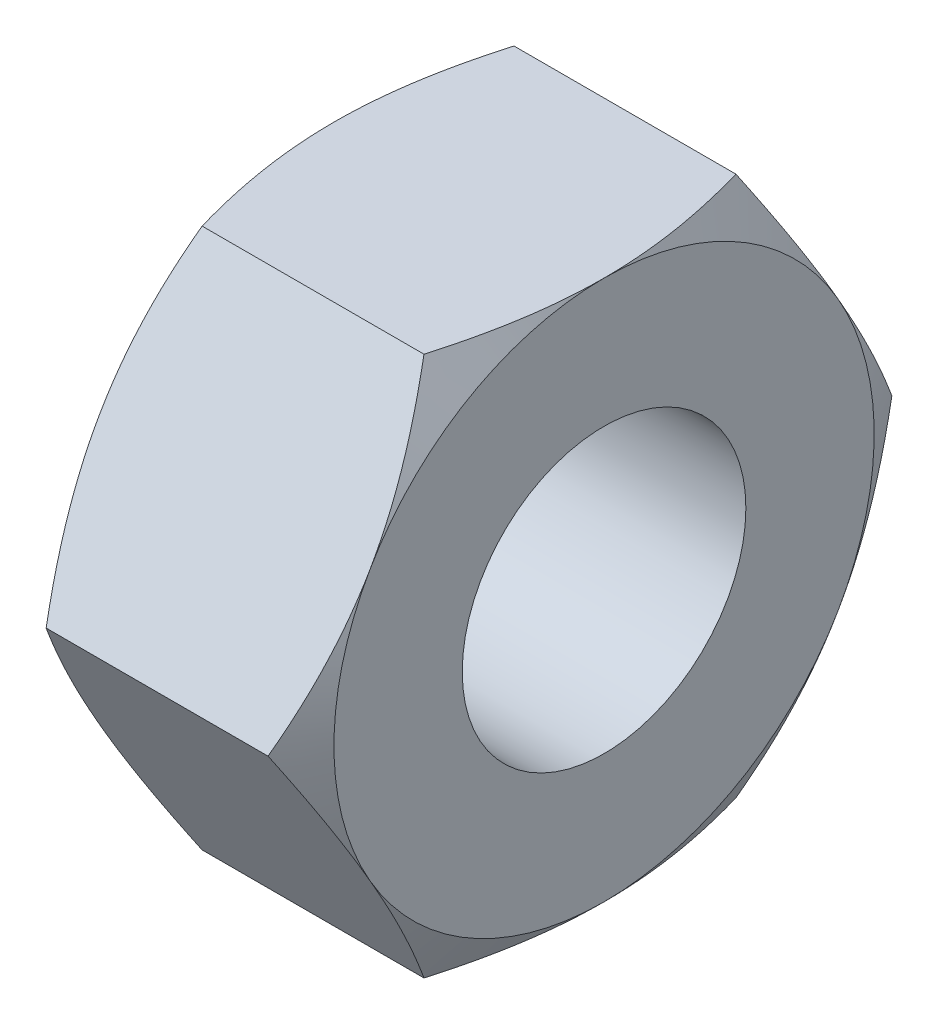
ISO-10303-21;
HEADER;
FILE_DESCRIPTION(('STEP AP214'),'2;1');
FILE_NAME('part.step','',(''),(''),'','','');
FILE_SCHEMA(('AUTOMOTIVE_DESIGN { 1 0 10303 214 1 1 1 1 }'));
ENDSEC;
DATA;
#1=APPLICATION_CONTEXT('core data for automotive mechanical design processes');
#2=APPLICATION_PROTOCOL_DEFINITION('international standard','automotive_design',2000,#1);
#3=PRODUCT_CONTEXT('',#1,'mechanical');
#4=PRODUCT('Part','Part','',(#3));
#5=PRODUCT_RELATED_PRODUCT_CATEGORY('part','',(#4));
#6=PRODUCT_DEFINITION_FORMATION('','',#4);
#7=PRODUCT_DEFINITION_CONTEXT('part definition',#1,'design');
#8=PRODUCT_DEFINITION('design','',#6,#7);
#9=PRODUCT_DEFINITION_SHAPE('','',#8);
#10=(LENGTH_UNIT() NAMED_UNIT(*) SI_UNIT(.MILLI.,.METRE.));
#11=(NAMED_UNIT(*) PLANE_ANGLE_UNIT() SI_UNIT($,.RADIAN.));
#12=(NAMED_UNIT(*) SI_UNIT($,.STERADIAN.) SOLID_ANGLE_UNIT());
#13=UNCERTAINTY_MEASURE_WITH_UNIT(LENGTH_MEASURE(1.E-05),#10,'distance_accuracy_value','');
#14=(GEOMETRIC_REPRESENTATION_CONTEXT(3) GLOBAL_UNCERTAINTY_ASSIGNED_CONTEXT((#13)) GLOBAL_UNIT_ASSIGNED_CONTEXT((#10,
#11,#12)) REPRESENTATION_CONTEXT('',''));
#15=CARTESIAN_POINT('',(0.,0.,0.));
#16=DIRECTION('',(0.,0.,1.));
#17=DIRECTION('',(1.,0.,0.));
#18=AXIS2_PLACEMENT_3D('',#15,#16,#17);
#19=CARTESIAN_POINT('',(-2.,-4.,-2.30940107675851));
#20=DIRECTION('',(-1.,0.,0.));
#21=DIRECTION('',(0.,0.,1.));
#22=AXIS2_PLACEMENT_3D('',#19,#20,#21);
#23=PLANE('',#22);
#24=CARTESIAN_POINT('',(-2.,0.,0.));
#25=DIRECTION('',(1.,0.,0.));
#26=DIRECTION('',(0.,0.,-1.));
#27=AXIS2_PLACEMENT_3D('',#24,#25,#26);
#28=CIRCLE('',#27,2.1);
#29=CARTESIAN_POINT('',(-2.,0.,-2.1));
#30=VERTEX_POINT('',#29);
#31=EDGE_CURVE('E133',#30,#30,#28,.T.);
#32=ORIENTED_EDGE('',*,*,#31,.T.);
#33=EDGE_LOOP('',(#32));
#34=FACE_BOUND('',#33,.T.);
#35=CARTESIAN_POINT('',(-2.,0.,0.));
#36=DIRECTION('',(1.,0.,0.));
#37=DIRECTION('',(0.,0.,-1.));
#38=AXIS2_PLACEMENT_3D('',#35,#36,#37);
#39=CIRCLE('',#38,4.);
#40=CARTESIAN_POINT('',(-2.,4.,0.));
#41=VERTEX_POINT('',#40);
#42=CARTESIAN_POINT('',(-2.,2.,3.46410161513775));
#43=VERTEX_POINT('',#42);
#44=EDGE_CURVE('E480',#41,#43,#39,.T.);
#45=ORIENTED_EDGE('',*,*,#44,.F.);
#46=CARTESIAN_POINT('',(-2.,2.,-3.46410161513775));
#47=VERTEX_POINT('',#46);
#48=EDGE_CURVE('E220',#47,#41,#39,.T.);
#49=ORIENTED_EDGE('',*,*,#48,.F.);
#50=CARTESIAN_POINT('',(-2.,-2.,-3.46410161513775));
#51=VERTEX_POINT('',#50);
#52=EDGE_CURVE('E31',#51,#47,#39,.T.);
#53=ORIENTED_EDGE('',*,*,#52,.F.);
#54=CARTESIAN_POINT('',(-2.,-4.,0.));
#55=VERTEX_POINT('',#54);
#56=EDGE_CURVE('E35',#55,#51,#39,.T.);
#57=ORIENTED_EDGE('',*,*,#56,.F.);
#58=CARTESIAN_POINT('',(-2.,-2.,3.46410161513775));
#59=VERTEX_POINT('',#58);
#60=EDGE_CURVE('E481',#59,#55,#39,.T.);
#61=ORIENTED_EDGE('',*,*,#60,.F.);
#62=EDGE_CURVE('E294',#43,#59,#39,.T.);
#63=ORIENTED_EDGE('',*,*,#62,.F.);
#64=EDGE_LOOP('',(#45,#49,#53,#57,#61,#63));
#65=FACE_BOUND('',#64,.T.);
#66=ADVANCED_FACE('F16',(#34,#65),#23,.T.);
#67=CARTESIAN_POINT('',(2.,-4.,-2.30940107675851));
#68=DIRECTION('',(0.,0.5,0.866025403784439));
#69=DIRECTION('',(0.,-0.866025403784439,0.5));
#70=AXIS2_PLACEMENT_3D('',#67,#68,#69);
#71=PLANE('',#70);
#72=CARTESIAN_POINT('',(-1.64266774092524,0.000199999999998344,-4.61891762357084));
#73=CARTESIAN_POINT('',(-1.70128212635172,-0.175579150323231,-4.5174314838138));
#74=CARTESIAN_POINT('',(-1.75458967853774,-0.352875616326384,-4.41506932144051));
#75=CARTESIAN_POINT('',(-1.8476383292536,-0.71053859317571,-4.20857250547739));
#76=CARTESIAN_POINT('',(-1.8873465109703,-0.890911458970154,-4.10443418285647));
#77=CARTESIAN_POINT('',(-1.94915778471972,-1.24942181870279,-3.89744813015756));
#78=CARTESIAN_POINT('',(-1.97167226847711,-1.42750415293514,-3.79463224655059));
#79=CARTESIAN_POINT('',(-1.99854937685342,-1.78450671716651,-3.58851671999023));
#80=CARTESIAN_POINT('',(-2.00293425857306,-1.9634256496441,-3.48521782616117));
#81=CARTESIAN_POINT('',(-1.99380992706003,-2.29774284219674,-3.29219970504619));
#82=CARTESIAN_POINT('',(-1.982541046012,-2.45319115998707,-3.20245157692486));
#83=CARTESIAN_POINT('',(-1.94682600920181,-2.76307505563506,-3.02354002635497));
#84=CARTESIAN_POINT('',(-1.92236765428847,-2.91750956174413,-2.93437722268073));
#85=CARTESIAN_POINT('',(-1.86122393508071,-3.22803232777458,-2.75509682012354));
#86=CARTESIAN_POINT('',(-1.82427939634514,-3.3840812880631,-2.6650019108942));
#87=CARTESIAN_POINT('',(-1.74042992745197,-3.69385183540384,-2.48615580200001));
#88=CARTESIAN_POINT('',(-1.69354469778726,-3.84757739077378,-2.39740231122585));
#89=CARTESIAN_POINT('',(-1.64266774092524,-4.0002,-2.30928560670467));
#90=B_SPLINE_CURVE_WITH_KNOTS('',3,(#72,#73,#74,#75,#76,#77,#78,#79,#80,#81,#82,#83,#84,#85,#86,
#87,#88,#89),.UNSPECIFIED.,.F.,.F.,(4,2,2,2,2,2,2,2,4),(0.,0.634047835695965,1.26961969224543,
1.88946157213122,2.50854226669297,3.04757825393385,3.58711366126903,4.13861653143763,
4.68903648037742),.UNSPECIFIED.);
#91=CARTESIAN_POINT('',(-1.64273441009184,-4.,-2.30940107675851));
#92=VERTEX_POINT('',#91);
#93=EDGE_CURVE('E102',#51,#92,#90,.T.);
#94=ORIENTED_EDGE('',*,*,#93,.F.);
#95=CARTESIAN_POINT('',(-1.64273441009184,0.,-4.61880215351701));
#96=VERTEX_POINT('',#95);
#97=EDGE_CURVE('E111',#96,#51,#90,.T.);
#98=ORIENTED_EDGE('',*,*,#97,.F.);
#99=DIRECTION('',(-1.,0.,0.));
#100=VECTOR('',#99,1.);
#101=CARTESIAN_POINT('',(2.,0.,-4.61880215351701));
#102=LINE('',#101,#100);
#103=CARTESIAN_POINT('',(1.64273441009184,0.,-4.61880215351701));
#104=VERTEX_POINT('',#103);
#105=EDGE_CURVE('E11',#104,#96,#102,.T.);
#106=ORIENTED_EDGE('',*,*,#105,.F.);
#107=CARTESIAN_POINT('',(1.64266774092524,0.000199999999998344,-4.61891762357084));
#108=CARTESIAN_POINT('',(1.70128212635172,-0.175579150323231,-4.5174314838138));
#109=CARTESIAN_POINT('',(1.75458967853774,-0.352875616326384,-4.41506932144051));
#110=CARTESIAN_POINT('',(1.8476383292536,-0.71053859317571,-4.20857250547739));
#111=CARTESIAN_POINT('',(1.8873465109703,-0.890911458970154,-4.10443418285647));
#112=CARTESIAN_POINT('',(1.94915778471972,-1.24942181870279,-3.89744813015756));
#113=CARTESIAN_POINT('',(1.97167226847711,-1.42750415293514,-3.79463224655059));
#114=CARTESIAN_POINT('',(1.99854937685342,-1.78450671716651,-3.58851671999023));
#115=CARTESIAN_POINT('',(2.00293425857306,-1.9634256496441,-3.48521782616117));
#116=CARTESIAN_POINT('',(1.99380992706003,-2.29774284219674,-3.29219970504619));
#117=CARTESIAN_POINT('',(1.982541046012,-2.45319115998707,-3.20245157692486));
#118=CARTESIAN_POINT('',(1.94682600920181,-2.76307505563506,-3.02354002635497));
#119=CARTESIAN_POINT('',(1.92236765428847,-2.91750956174413,-2.93437722268073));
#120=CARTESIAN_POINT('',(1.86122393508071,-3.22803232777458,-2.75509682012354));
#121=CARTESIAN_POINT('',(1.82427939634514,-3.3840812880631,-2.6650019108942));
#122=CARTESIAN_POINT('',(1.74042992745197,-3.69385183540384,-2.48615580200001));
#123=CARTESIAN_POINT('',(1.69354469778726,-3.84757739077378,-2.39740231122585));
#124=CARTESIAN_POINT('',(1.64266774092524,-4.0002,-2.30928560670467));
#125=B_SPLINE_CURVE_WITH_KNOTS('',3,(#107,#108,#109,#110,#111,#112,#113,#114,#115,#116,#117,
#118,#119,#120,#121,#122,#123,#124),.UNSPECIFIED.,.F.,.F.,(4,2,2,2,2,2,2,2,4),(0.,
0.634047835695965,1.26961969224543,1.88946157213122,2.50854226669297,3.04757825393385,
3.58711366126903,4.13861653143763,4.68903648037742),.UNSPECIFIED.);
#126=CARTESIAN_POINT('',(2.,-2.,-3.46410161513775));
#127=VERTEX_POINT('',#126);
#128=EDGE_CURVE('E166',#104,#127,#125,.T.);
#129=ORIENTED_EDGE('',*,*,#128,.T.);
#130=CARTESIAN_POINT('',(1.6427344100922,-4.,-2.30940107675906));
#131=VERTEX_POINT('',#130);
#132=EDGE_CURVE('E125',#127,#131,#125,.T.);
#133=ORIENTED_EDGE('',*,*,#132,.T.);
#134=DIRECTION('',(-1.,0.,0.));
#135=VECTOR('',#134,1.);
#136=CARTESIAN_POINT('',(2.,-4.,-2.30940107675851));
#137=LINE('',#136,#135);
#138=EDGE_CURVE('E118',#131,#92,#137,.T.);
#139=ORIENTED_EDGE('',*,*,#138,.T.);
#140=EDGE_LOOP('',(#94,#98,#106,#129,#133,#139));
#141=FACE_BOUND('',#140,.T.);
#142=ADVANCED_FACE('F18',(#141),#71,.F.);
#143=CARTESIAN_POINT('',(2.,0.,-4.61880215351701));
#144=DIRECTION('',(0.,-0.5,0.866025403784439));
#145=DIRECTION('',(0.,-0.866025403784439,-0.5));
#146=AXIS2_PLACEMENT_3D('',#143,#144,#145);
#147=PLANE('',#146);
#148=CARTESIAN_POINT('',(-1.64266774092524,4.0002,-2.30928560670467));
#149=CARTESIAN_POINT('',(-1.70128212635172,3.82442084967677,-2.41077174646171));
#150=CARTESIAN_POINT('',(-1.75458967853774,3.64712438367362,-2.513133908835));
#151=CARTESIAN_POINT('',(-1.8476383292536,3.2894614068243,-2.71963072479812));
#152=CARTESIAN_POINT('',(-1.88734651097029,3.10908854102985,-2.82376904741904));
#153=CARTESIAN_POINT('',(-1.94915778471972,2.75057818129721,-3.03075510011795));
#154=CARTESIAN_POINT('',(-1.97167226847711,2.57249584706486,-3.13357098372492));
#155=CARTESIAN_POINT('',(-1.99854937685342,2.21549328283349,-3.33968651028528));
#156=CARTESIAN_POINT('',(-2.00293425857306,2.0365743503559,-3.44298540411434));
#157=CARTESIAN_POINT('',(-1.99380992706003,1.70225715780327,-3.63600352522932));
#158=CARTESIAN_POINT('',(-1.982541046012,1.54680884001294,-3.72575165335065));
#159=CARTESIAN_POINT('',(-1.94682600920181,1.23692494436495,-3.90466320392055));
#160=CARTESIAN_POINT('',(-1.92236765428847,1.08249043825587,-3.99382600759479));
#161=CARTESIAN_POINT('',(-1.86122393508071,0.771967672225423,-4.17310641015197));
#162=CARTESIAN_POINT('',(-1.82427939634514,0.615918711936899,-4.26320131938131));
#163=CARTESIAN_POINT('',(-1.74042992745197,0.306148164596162,-4.4420474282755));
#164=CARTESIAN_POINT('',(-1.69354469778726,0.152422609226222,-4.53080091904966));
#165=CARTESIAN_POINT('',(-1.64266774092524,-0.000200000000001705,-4.61891762357084));
#166=B_SPLINE_CURVE_WITH_KNOTS('',3,(#148,#149,#150,#151,#152,#153,#154,#155,#156,#157,#158,
#159,#160,#161,#162,#163,#164,#165),.UNSPECIFIED.,.F.,.F.,(4,2,2,2,2,2,2,2,4),(0.,
0.634047835695965,1.26961969224543,1.88946157213122,2.50854226669297,3.04757825393386,
3.58711366126903,4.13861653143764,4.68903648037743),.UNSPECIFIED.);
#167=EDGE_CURVE('E263',#47,#96,#166,.T.);
#168=ORIENTED_EDGE('',*,*,#167,.F.);
#169=CARTESIAN_POINT('',(-1.64273441009184,4.,-2.30940107675851));
#170=VERTEX_POINT('',#169);
#171=EDGE_CURVE('E112',#170,#47,#166,.T.);
#172=ORIENTED_EDGE('',*,*,#171,.F.);
#173=DIRECTION('',(-1.,0.,0.));
#174=VECTOR('',#173,1.);
#175=CARTESIAN_POINT('',(2.,4.,-2.30940107675851));
#176=LINE('',#175,#174);
#177=CARTESIAN_POINT('',(1.64273441009184,4.,-2.30940107675851));
#178=VERTEX_POINT('',#177);
#179=EDGE_CURVE('E24',#178,#170,#176,.T.);
#180=ORIENTED_EDGE('',*,*,#179,.F.);
#181=CARTESIAN_POINT('',(1.64266774092524,4.0002,-2.30928560670467));
#182=CARTESIAN_POINT('',(1.70128212635172,3.82442084967677,-2.41077174646171));
#183=CARTESIAN_POINT('',(1.75458967853774,3.64712438367362,-2.513133908835));
#184=CARTESIAN_POINT('',(1.8476383292536,3.2894614068243,-2.71963072479812));
#185=CARTESIAN_POINT('',(1.88734651097029,3.10908854102985,-2.82376904741904));
#186=CARTESIAN_POINT('',(1.94915778471972,2.75057818129721,-3.03075510011795));
#187=CARTESIAN_POINT('',(1.97167226847711,2.57249584706486,-3.13357098372492));
#188=CARTESIAN_POINT('',(1.99854937685342,2.21549328283349,-3.33968651028528));
#189=CARTESIAN_POINT('',(2.00293425857306,2.0365743503559,-3.44298540411434));
#190=CARTESIAN_POINT('',(1.99380992706003,1.70225715780327,-3.63600352522932));
#191=CARTESIAN_POINT('',(1.982541046012,1.54680884001294,-3.72575165335065));
#192=CARTESIAN_POINT('',(1.94682600920181,1.23692494436495,-3.90466320392055));
#193=CARTESIAN_POINT('',(1.92236765428847,1.08249043825587,-3.99382600759479));
#194=CARTESIAN_POINT('',(1.86122393508071,0.771967672225423,-4.17310641015197));
#195=CARTESIAN_POINT('',(1.82427939634514,0.615918711936899,-4.26320131938131));
#196=CARTESIAN_POINT('',(1.74042992745197,0.306148164596162,-4.4420474282755));
#197=CARTESIAN_POINT('',(1.69354469778726,0.152422609226222,-4.53080091904966));
#198=CARTESIAN_POINT('',(1.64266774092524,-0.000200000000001705,-4.61891762357084));
#199=B_SPLINE_CURVE_WITH_KNOTS('',3,(#181,#182,#183,#184,#185,#186,#187,#188,#189,#190,#191,
#192,#193,#194,#195,#196,#197,#198),.UNSPECIFIED.,.F.,.F.,(4,2,2,2,2,2,2,2,4),(0.,
0.634047835695965,1.26961969224543,1.88946157213122,2.50854226669297,3.04757825393386,
3.58711366126903,4.13861653143764,4.68903648037743),.UNSPECIFIED.);
#200=CARTESIAN_POINT('',(2.,2.,-3.46410161513775));
#201=VERTEX_POINT('',#200);
#202=EDGE_CURVE('E157',#178,#201,#199,.T.);
#203=ORIENTED_EDGE('',*,*,#202,.T.);
#204=EDGE_CURVE('E164',#201,#104,#199,.T.);
#205=ORIENTED_EDGE('',*,*,#204,.T.);
#206=ORIENTED_EDGE('',*,*,#105,.T.);
#207=EDGE_LOOP('',(#168,#172,#180,#203,#205,#206));
#208=FACE_BOUND('',#207,.T.);
#209=ADVANCED_FACE('F156',(#208),#147,.F.);
#210=CARTESIAN_POINT('',(2.,4.,-2.30940107675851));
#211=DIRECTION('',(0.,-1.,0.));
#212=DIRECTION('',(0.,0.,-1.));
#213=AXIS2_PLACEMENT_3D('',#210,#211,#212);
#214=PLANE('',#213);
#215=CARTESIAN_POINT('',(-0.0424878092924402,4.,-6.21447073339589));
#216=CARTESIAN_POINT('',(-0.127351613558699,4.,-6.0396183256206));
#217=CARTESIAN_POINT('',(-0.21140471296775,4.,-5.86436561404375));
#218=CARTESIAN_POINT('',(-0.377433582477088,4.,-5.5128466430601));
#219=CARTESIAN_POINT('',(-0.459409026889743,4.,-5.33658022999682));
#220=CARTESIAN_POINT('',(-0.621236406020319,4.,-4.98191870371583));
#221=CARTESIAN_POINT('',(-0.701074456545692,4.,-4.80351723345339));
#222=CARTESIAN_POINT('',(-0.857496478137951,4.,-4.44529861455654));
#223=CARTESIAN_POINT('',(-0.934080602505362,4.,-4.26548153308923));
#224=CARTESIAN_POINT('',(-1.08550256214435,4.,-3.89840789182473));
#225=CARTESIAN_POINT('',(-1.16020783030021,4.,-3.71109634781926));
#226=CARTESIAN_POINT('',(-1.30399127038016,4.,-3.33428626892711));
#227=CARTESIAN_POINT('',(-1.37306881288743,4.,-3.14478749211415));
#228=CARTESIAN_POINT('',(-1.503792383855,4.,-2.76365206062652));
#229=CARTESIAN_POINT('',(-1.56545333119033,4.,-2.57202057460323));
#230=CARTESIAN_POINT('',(-1.67937298125012,4.,-2.18600937849997));
#231=CARTESIAN_POINT('',(-1.73163463099794,4.,-1.99163055050095));
#232=CARTESIAN_POINT('',(-1.82399073804893,4.,-1.6010395958577));
#233=CARTESIAN_POINT('',(-1.86414824658267,4.,-1.40484265691068));
#234=CARTESIAN_POINT('',(-1.9300137776466,4.,-1.00999836516601));
#235=CARTESIAN_POINT('',(-1.95572328462399,4.,-0.811351266251908));
#236=CARTESIAN_POINT('',(-1.99030612537942,4.,-0.415198077025975));
#237=CARTESIAN_POINT('',(-1.99939684433401,4.,-0.217711443134732));
#238=CARTESIAN_POINT('',(-2.00054431746841,4.,0.177330995286892));
#239=CARTESIAN_POINT('',(-1.9926005017144,4.,0.374886801910515));
#240=CARTESIAN_POINT('',(-1.96525154953382,4.,0.709857582976532));
#241=CARTESIAN_POINT('',(-1.94997310943552,4.,0.847630200191343));
#242=CARTESIAN_POINT('',(-1.91207564794806,4.,1.12216892965561));
#243=CARTESIAN_POINT('',(-1.88945564443709,4.,1.25893490473615));
#244=CARTESIAN_POINT('',(-1.81177225564822,4.,1.66753166373138));
#245=CARTESIAN_POINT('',(-1.74689872591423,4.,1.93751819884844));
#246=CARTESIAN_POINT('',(-1.63433899420949,4.,2.34141488866647));
#247=CARTESIAN_POINT('',(-1.59372208224944,4.,2.47741402190499));
#248=CARTESIAN_POINT('',(-1.50826048812494,4.,2.74809025415673));
#249=CARTESIAN_POINT('',(-1.46341577333139,4.,2.88276734295789));
#250=CARTESIAN_POINT('',(-1.37021924621611,4.,3.15084486713317));
#251=CARTESIAN_POINT('',(-1.32186851821546,4.,3.28424568290032));
#252=CARTESIAN_POINT('',(-1.22222993029444,4.,3.54993863663534));
#253=CARTESIAN_POINT('',(-1.17094214171142,4.,3.6822308014415));
#254=CARTESIAN_POINT('',(-1.02563622023204,4.,4.04695465555703));
#255=CARTESIAN_POINT('',(-0.929021650558054,4.,4.27835104719763));
#256=CARTESIAN_POINT('',(-0.730187852964453,4.,4.73873215924535));
#257=CARTESIAN_POINT('',(-0.627967976954074,4.,4.96771659711595));
#258=CARTESIAN_POINT('',(-0.419297579372636,4.,5.4238424448388));
#259=CARTESIAN_POINT('',(-0.312845554621115,4.,5.6509831647138));
#260=CARTESIAN_POINT('',(-0.0967433277952712,4.,6.10374131486461));
#261=CARTESIAN_POINT('',(0.0129069717704638,4.,6.32935869844662));
#262=CARTESIAN_POINT('',(0.23485963439115,4.,6.77972688134291));
#263=CARTESIAN_POINT('',(0.347165922687314,4.,7.00447574225));
#264=CARTESIAN_POINT('',(0.573740552912192,4.,7.4529833078244));
#265=CARTESIAN_POINT('',(0.688008914774191,4.,7.67674200240322));
#266=CARTESIAN_POINT('',(1.03309071408151,4.,8.34671424696929));
#267=CARTESIAN_POINT('',(1.26623258411182,4.,8.7917278951712));
#268=CARTESIAN_POINT('',(1.7109069594873,4.,9.63103051544466));
#269=CARTESIAN_POINT('',(1.92201495669699,4.,10.0255454645977));
#270=CARTESIAN_POINT('',(2.34662194321588,4.,10.8133186136335));
#271=CARTESIAN_POINT('',(2.56012108495381,4.,11.2065767313191));
#272=CARTESIAN_POINT('',(2.9881698404675,4.,11.9908278398692));
#273=CARTESIAN_POINT('',(3.20271362390135,4.,12.3818240177721));
#274=CARTESIAN_POINT('',(3.63314694892205,4.,13.1630345650918));
#275=CARTESIAN_POINT('',(3.84903638181796,4.,13.5532489943723));
#276=CARTESIAN_POINT('',(4.06541385496577,4.,13.9431910057166));
#277=B_SPLINE_CURVE_WITH_KNOTS('',3,(#215,#216,#217,#218,#219,#220,#221,#222,#223,#224,#225,
#226,#227,#228,#229,#230,#231,#232,#233,#234,#235,#236,#237,#238,#239,#240,#241,#242,#243,#244,
#245,#246,#247,#248,#249,#250,#251,#252,#253,#254,#255,#256,#257,#258,#259,#260,#261,#262,#263,
#264,#265,#266,#267,#268,#269,#270,#271,#272,#273,#274,#275,#276),.UNSPECIFIED.,.F.,.F.,(4,2,2,
2,2,2,2,2,2,2,2,2,2,2,2,2,2,2,2,2,2,2,2,2,2,2,2,2,2,2,4),(0.,0.583082605837965,1.16625605579355,
1.75258384250784,2.3388839751674,2.94379211515442,3.54876781674333,4.15250547029922,
4.75605349877387,5.35640100034463,5.9566868084568,6.54906268949767,7.14145839029456,
7.55710878833946,7.97281481318691,8.80465598775476,9.23042410092923,9.65619550034297,
10.0818357765123,10.5074657188175,11.2596212520816,12.0118639343932,12.7643762290397,
13.5169114861643,14.2706385930645,15.0243733618376,16.5314946529553,17.8738267846276,
19.2162449788296,20.554212056764,21.8920724296771),.UNSPECIFIED.);
#278=EDGE_CURVE('E147',#41,#170,#277,.F.);
#279=ORIENTED_EDGE('',*,*,#278,.F.);
#280=CARTESIAN_POINT('',(-1.64273441009184,4.,2.30940107675851));
#281=VERTEX_POINT('',#280);
#282=EDGE_CURVE('E268',#281,#41,#277,.F.);
#283=ORIENTED_EDGE('',*,*,#282,.F.);
#284=DIRECTION('',(-1.,0.,0.));
#285=VECTOR('',#284,1.);
#286=CARTESIAN_POINT('',(2.,4.,2.30940107675851));
#287=LINE('',#286,#285);
#288=CARTESIAN_POINT('',(1.64273441009184,4.,2.30940107675851));
#289=VERTEX_POINT('',#288);
#290=EDGE_CURVE('E139',#289,#281,#287,.T.);
#291=ORIENTED_EDGE('',*,*,#290,.F.);
#292=CARTESIAN_POINT('',(0.0424878092924402,4.,-6.21447073339589));
#293=CARTESIAN_POINT('',(0.127351613558699,4.,-6.0396183256206));
#294=CARTESIAN_POINT('',(0.21140471296775,4.,-5.86436561404375));
#295=CARTESIAN_POINT('',(0.377433582477088,4.,-5.5128466430601));
#296=CARTESIAN_POINT('',(0.459409026889743,4.,-5.33658022999682));
#297=CARTESIAN_POINT('',(0.621236406020319,4.,-4.98191870371583));
#298=CARTESIAN_POINT('',(0.701074456545692,4.,-4.80351723345339));
#299=CARTESIAN_POINT('',(0.857496478137951,4.,-4.44529861455654));
#300=CARTESIAN_POINT('',(0.934080602505362,4.,-4.26548153308923));
#301=CARTESIAN_POINT('',(1.08550256214435,4.,-3.89840789182473));
#302=CARTESIAN_POINT('',(1.16020783030021,4.,-3.71109634781926));
#303=CARTESIAN_POINT('',(1.30399127038016,4.,-3.33428626892711));
#304=CARTESIAN_POINT('',(1.37306881288743,4.,-3.14478749211415));
#305=CARTESIAN_POINT('',(1.503792383855,4.,-2.76365206062652));
#306=CARTESIAN_POINT('',(1.56545333119033,4.,-2.57202057460323));
#307=CARTESIAN_POINT('',(1.67937298125012,4.,-2.18600937849997));
#308=CARTESIAN_POINT('',(1.73163463099794,4.,-1.99163055050095));
#309=CARTESIAN_POINT('',(1.82399073804893,4.,-1.6010395958577));
#310=CARTESIAN_POINT('',(1.86414824658267,4.,-1.40484265691068));
#311=CARTESIAN_POINT('',(1.9300137776466,4.,-1.00999836516601));
#312=CARTESIAN_POINT('',(1.95572328462399,4.,-0.811351266251908));
#313=CARTESIAN_POINT('',(1.99030612537942,4.,-0.415198077025975));
#314=CARTESIAN_POINT('',(1.99939684433401,4.,-0.217711443134732));
#315=CARTESIAN_POINT('',(2.00054431746841,4.,0.177330995286892));
#316=CARTESIAN_POINT('',(1.9926005017144,4.,0.374886801910515));
#317=CARTESIAN_POINT('',(1.96525154953382,4.,0.709857582976532));
#318=CARTESIAN_POINT('',(1.94997310943552,4.,0.847630200191343));
#319=CARTESIAN_POINT('',(1.91207564794806,4.,1.12216892965561));
#320=CARTESIAN_POINT('',(1.88945564443709,4.,1.25893490473615));
#321=CARTESIAN_POINT('',(1.81177225564822,4.,1.66753166373138));
#322=CARTESIAN_POINT('',(1.74689872591423,4.,1.93751819884844));
#323=CARTESIAN_POINT('',(1.63433899420949,4.,2.34141488866647));
#324=CARTESIAN_POINT('',(1.59372208224944,4.,2.47741402190499));
#325=CARTESIAN_POINT('',(1.50826048812494,4.,2.74809025415673));
#326=CARTESIAN_POINT('',(1.46341577333139,4.,2.88276734295789));
#327=CARTESIAN_POINT('',(1.37021924621611,4.,3.15084486713317));
#328=CARTESIAN_POINT('',(1.32186851821546,4.,3.28424568290032));
#329=CARTESIAN_POINT('',(1.22222993029444,4.,3.54993863663534));
#330=CARTESIAN_POINT('',(1.17094214171142,4.,3.6822308014415));
#331=CARTESIAN_POINT('',(1.02563622023204,4.,4.04695465555703));
#332=CARTESIAN_POINT('',(0.929021650558054,4.,4.27835104719763));
#333=CARTESIAN_POINT('',(0.730187852964453,4.,4.73873215924535));
#334=CARTESIAN_POINT('',(0.627967976954074,4.,4.96771659711595));
#335=CARTESIAN_POINT('',(0.419297579372636,4.,5.4238424448388));
#336=CARTESIAN_POINT('',(0.312845554621115,4.,5.6509831647138));
#337=CARTESIAN_POINT('',(0.0967433277952712,4.,6.10374131486461));
#338=CARTESIAN_POINT('',(-0.0129069717704638,4.,6.32935869844662));
#339=CARTESIAN_POINT('',(-0.23485963439115,4.,6.77972688134291));
#340=CARTESIAN_POINT('',(-0.347165922687314,4.,7.00447574225));
#341=CARTESIAN_POINT('',(-0.573740552912192,4.,7.4529833078244));
#342=CARTESIAN_POINT('',(-0.688008914774191,4.,7.67674200240322));
#343=CARTESIAN_POINT('',(-1.03309071408151,4.,8.34671424696929));
#344=CARTESIAN_POINT('',(-1.26623258411182,4.,8.7917278951712));
#345=CARTESIAN_POINT('',(-1.7109069594873,4.,9.63103051544466));
#346=CARTESIAN_POINT('',(-1.92201495669699,4.,10.0255454645977));
#347=CARTESIAN_POINT('',(-2.34662194321588,4.,10.8133186136335));
#348=CARTESIAN_POINT('',(-2.56012108495381,4.,11.2065767313191));
#349=CARTESIAN_POINT('',(-2.9881698404675,4.,11.9908278398692));
#350=CARTESIAN_POINT('',(-3.20271362390135,4.,12.3818240177721));
#351=CARTESIAN_POINT('',(-3.63314694892205,4.,13.1630345650918));
#352=CARTESIAN_POINT('',(-3.84903638181796,4.,13.5532489943723));
#353=CARTESIAN_POINT('',(-4.06541385496577,4.,13.9431910057166));
#354=B_SPLINE_CURVE_WITH_KNOTS('',3,(#292,#293,#294,#295,#296,#297,#298,#299,#300,#301,#302,
#303,#304,#305,#306,#307,#308,#309,#310,#311,#312,#313,#314,#315,#316,#317,#318,#319,#320,#321,
#322,#323,#324,#325,#326,#327,#328,#329,#330,#331,#332,#333,#334,#335,#336,#337,#338,#339,#340,
#341,#342,#343,#344,#345,#346,#347,#348,#349,#350,#351,#352,#353),.UNSPECIFIED.,.F.,.F.,(4,2,2,
2,2,2,2,2,2,2,2,2,2,2,2,2,2,2,2,2,2,2,2,2,2,2,2,2,2,2,4),(0.,0.583082605837965,1.16625605579355,
1.75258384250784,2.3388839751674,2.94379211515442,3.54876781674333,4.15250547029922,
4.75605349877387,5.35640100034463,5.9566868084568,6.54906268949767,7.14145839029456,
7.55710878833946,7.97281481318691,8.80465598775476,9.23042410092923,9.65619550034297,
10.0818357765123,10.5074657188175,11.2596212520816,12.0118639343932,12.7643762290397,
13.5169114861643,14.2706385930645,15.0243733618376,16.5314946529553,17.8738267846276,
19.2162449788296,20.554212056764,21.8920724296771),.UNSPECIFIED.);
#355=CARTESIAN_POINT('',(2.,4.,0.));
#356=VERTEX_POINT('',#355);
#357=EDGE_CURVE('E168',#289,#356,#354,.F.);
#358=ORIENTED_EDGE('',*,*,#357,.T.);
#359=EDGE_CURVE('E150',#356,#178,#354,.F.);
#360=ORIENTED_EDGE('',*,*,#359,.T.);
#361=ORIENTED_EDGE('',*,*,#179,.T.);
#362=EDGE_LOOP('',(#279,#283,#291,#358,#360,#361));
#363=FACE_BOUND('',#362,.T.);
#364=ADVANCED_FACE('F145',(#363),#214,.F.);
#365=CARTESIAN_POINT('',(2.,4.,2.30940107675851));
#366=DIRECTION('',(0.,-0.5,-0.866025403784439));
#367=DIRECTION('',(0.,0.866025403784439,-0.5));
#368=AXIS2_PLACEMENT_3D('',#365,#366,#367);
#369=PLANE('',#368);
#370=ORIENTED_EDGE('',*,*,#290,.T.);
#371=CARTESIAN_POINT('',(-1.64266774092524,-0.000199999999999114,4.61891762357084));
#372=CARTESIAN_POINT('',(-1.70128212635172,0.17557915032323,4.5174314838138));
#373=CARTESIAN_POINT('',(-1.75458967853774,0.352875616326384,4.41506932144051));
#374=CARTESIAN_POINT('',(-1.8476383292536,0.71053859317571,4.20857250547739));
#375=CARTESIAN_POINT('',(-1.8873465109703,0.890911458970154,4.10443418285647));
#376=CARTESIAN_POINT('',(-1.94915778471972,1.24942181870279,3.89744813015756));
#377=CARTESIAN_POINT('',(-1.97167226847711,1.42750415293515,3.79463224655059));
#378=CARTESIAN_POINT('',(-1.99854937685342,1.78450671716651,3.58851671999023));
#379=CARTESIAN_POINT('',(-2.00293425857306,1.9634256496441,3.48521782616117));
#380=CARTESIAN_POINT('',(-1.99380992706003,2.29774284219673,3.29219970504619));
#381=CARTESIAN_POINT('',(-1.98254104601201,2.45319115998707,3.20245157692486));
#382=CARTESIAN_POINT('',(-1.94682600920181,2.76307505563506,3.02354002635497));
#383=CARTESIAN_POINT('',(-1.92236765428847,2.91750956174413,2.93437722268073));
#384=CARTESIAN_POINT('',(-1.86122393508071,3.22803232777458,2.75509682012354));
#385=CARTESIAN_POINT('',(-1.82427939634514,3.3840812880631,2.6650019108942));
#386=CARTESIAN_POINT('',(-1.74042992745197,3.69385183540384,2.48615580200001));
#387=CARTESIAN_POINT('',(-1.69354469778726,3.84757739077378,2.39740231122585));
#388=CARTESIAN_POINT('',(-1.64266774092524,4.0002,2.30928560670467));
#389=B_SPLINE_CURVE_WITH_KNOTS('',3,(#371,#372,#373,#374,#375,#376,#377,#378,#379,#380,#381,
#382,#383,#384,#385,#386,#387,#388),.UNSPECIFIED.,.F.,.F.,(4,2,2,2,2,2,2,2,4),(0.,
0.634047835695966,1.26961969224543,1.88946157213122,2.50854226669297,3.04757825393385,
3.58711366126903,4.13861653143763,4.68903648037743),.UNSPECIFIED.);
#390=EDGE_CURVE('E250',#43,#281,#389,.T.);
#391=ORIENTED_EDGE('',*,*,#390,.F.);
#392=CARTESIAN_POINT('',(-1.64273441009184,0.,4.61880215351701));
#393=VERTEX_POINT('',#392);
#394=EDGE_CURVE('E281',#393,#43,#389,.T.);
#395=ORIENTED_EDGE('',*,*,#394,.F.);
#396=DIRECTION('',(-1.,0.,0.));
#397=VECTOR('',#396,1.);
#398=CARTESIAN_POINT('',(2.,0.,4.61880215351701));
#399=LINE('',#398,#397);
#400=CARTESIAN_POINT('',(1.64273441009184,0.,4.61880215351701));
#401=VERTEX_POINT('',#400);
#402=EDGE_CURVE('E130',#401,#393,#399,.T.);
#403=ORIENTED_EDGE('',*,*,#402,.F.);
#404=CARTESIAN_POINT('',(1.64266774092524,-0.000199999999999114,4.61891762357084));
#405=CARTESIAN_POINT('',(1.70128212635172,0.17557915032323,4.5174314838138));
#406=CARTESIAN_POINT('',(1.75458967853774,0.352875616326384,4.41506932144051));
#407=CARTESIAN_POINT('',(1.8476383292536,0.71053859317571,4.20857250547739));
#408=CARTESIAN_POINT('',(1.8873465109703,0.890911458970154,4.10443418285647));
#409=CARTESIAN_POINT('',(1.94915778471972,1.24942181870279,3.89744813015756));
#410=CARTESIAN_POINT('',(1.97167226847711,1.42750415293515,3.79463224655059));
#411=CARTESIAN_POINT('',(1.99854937685342,1.78450671716651,3.58851671999023));
#412=CARTESIAN_POINT('',(2.00293425857306,1.9634256496441,3.48521782616117));
#413=CARTESIAN_POINT('',(1.99380992706003,2.29774284219673,3.29219970504619));
#414=CARTESIAN_POINT('',(1.98254104601201,2.45319115998707,3.20245157692486));
#415=CARTESIAN_POINT('',(1.94682600920181,2.76307505563506,3.02354002635497));
#416=CARTESIAN_POINT('',(1.92236765428847,2.91750956174413,2.93437722268073));
#417=CARTESIAN_POINT('',(1.86122393508071,3.22803232777458,2.75509682012354));
#418=CARTESIAN_POINT('',(1.82427939634514,3.3840812880631,2.6650019108942));
#419=CARTESIAN_POINT('',(1.74042992745197,3.69385183540384,2.48615580200001));
#420=CARTESIAN_POINT('',(1.69354469778726,3.84757739077378,2.39740231122585));
#421=CARTESIAN_POINT('',(1.64266774092524,4.0002,2.30928560670467));
#422=B_SPLINE_CURVE_WITH_KNOTS('',3,(#404,#405,#406,#407,#408,#409,#410,#411,#412,#413,#414,
#415,#416,#417,#418,#419,#420,#421),.UNSPECIFIED.,.F.,.F.,(4,2,2,2,2,2,2,2,4),(0.,
0.634047835695966,1.26961969224543,1.88946157213122,2.50854226669297,3.04757825393385,
3.58711366126903,4.13861653143763,4.68903648037743),.UNSPECIFIED.);
#423=CARTESIAN_POINT('',(2.,2.,3.46410161513775));
#424=VERTEX_POINT('',#423);
#425=EDGE_CURVE('E205',#401,#424,#422,.T.);
#426=ORIENTED_EDGE('',*,*,#425,.T.);
#427=EDGE_CURVE('E199',#424,#289,#422,.T.);
#428=ORIENTED_EDGE('',*,*,#427,.T.);
#429=EDGE_LOOP('',(#370,#391,#395,#403,#426,#428));
#430=FACE_BOUND('',#429,.T.);
#431=ADVANCED_FACE('F298',(#430),#369,.F.);
#432=CARTESIAN_POINT('',(2.,0.,4.61880215351701));
#433=DIRECTION('',(0.,0.5,-0.866025403784439));
#434=DIRECTION('',(0.,0.866025403784439,0.5));
#435=AXIS2_PLACEMENT_3D('',#432,#433,#434);
#436=PLANE('',#435);
#437=ORIENTED_EDGE('',*,*,#402,.T.);
#438=CARTESIAN_POINT('',(-1.64266774092524,-4.0002,2.30928560670467));
#439=CARTESIAN_POINT('',(-1.70128212635172,-3.82442084967677,2.41077174646171));
#440=CARTESIAN_POINT('',(-1.75458967853774,-3.64712438367362,2.513133908835));
#441=CARTESIAN_POINT('',(-1.84763832925359,-3.2894614068243,2.71963072479812));
#442=CARTESIAN_POINT('',(-1.88734651097029,-3.10908854102985,2.82376904741904));
#443=CARTESIAN_POINT('',(-1.94915778471972,-2.75057818129721,3.03075510011795));
#444=CARTESIAN_POINT('',(-1.97167226847711,-2.57249584706486,3.13357098372492));
#445=CARTESIAN_POINT('',(-1.99854937685342,-2.21549328283349,3.33968651028528));
#446=CARTESIAN_POINT('',(-2.00293425857306,-2.0365743503559,3.44298540411434));
#447=CARTESIAN_POINT('',(-1.99380992706003,-1.70225715780327,3.63600352522932));
#448=CARTESIAN_POINT('',(-1.98254104601201,-1.54680884001294,3.72575165335065));
#449=CARTESIAN_POINT('',(-1.9468260092018,-1.23692494436495,3.90466320392055));
#450=CARTESIAN_POINT('',(-1.92236765428847,-1.08249043825587,3.99382600759479));
#451=CARTESIAN_POINT('',(-1.86122393508071,-0.771967672225425,4.17310641015197));
#452=CARTESIAN_POINT('',(-1.82427939634514,-0.615918711936901,4.26320131938131));
#453=CARTESIAN_POINT('',(-1.74042992745197,-0.306148164596163,4.4420474282755));
#454=CARTESIAN_POINT('',(-1.69354469778726,-0.152422609226222,4.53080091904966));
#455=CARTESIAN_POINT('',(-1.64266774092524,0.000200000000000857,4.61891762357084));
#456=B_SPLINE_CURVE_WITH_KNOTS('',3,(#438,#439,#440,#441,#442,#443,#444,#445,#446,#447,#448,
#449,#450,#451,#452,#453,#454,#455),.UNSPECIFIED.,.F.,.F.,(4,2,2,2,2,2,2,2,4),(0.,
0.634047835695965,1.26961969224543,1.88946157213122,2.50854226669297,3.04757825393385,
3.58711366126903,4.13861653143764,4.68903648037743),.UNSPECIFIED.);
#457=EDGE_CURVE('E122',#59,#393,#456,.T.);
#458=ORIENTED_EDGE('',*,*,#457,.F.);
#459=CARTESIAN_POINT('',(-1.64273441009184,-4.,2.3094010767585));
#460=VERTEX_POINT('',#459);
#461=EDGE_CURVE('E289',#460,#59,#456,.T.);
#462=ORIENTED_EDGE('',*,*,#461,.F.);
#463=DIRECTION('',(-1.,0.,0.));
#464=VECTOR('',#463,1.);
#465=CARTESIAN_POINT('',(2.,-4.,2.3094010767585));
#466=LINE('',#465,#464);
#467=CARTESIAN_POINT('',(1.64273441009184,-4.,2.3094010767585));
#468=VERTEX_POINT('',#467);
#469=EDGE_CURVE('E127',#468,#460,#466,.T.);
#470=ORIENTED_EDGE('',*,*,#469,.F.);
#471=CARTESIAN_POINT('',(1.64266774092524,-4.0002,2.30928560670467));
#472=CARTESIAN_POINT('',(1.70128212635172,-3.82442084967677,2.41077174646171));
#473=CARTESIAN_POINT('',(1.75458967853774,-3.64712438367362,2.513133908835));
#474=CARTESIAN_POINT('',(1.84763832925359,-3.2894614068243,2.71963072479812));
#475=CARTESIAN_POINT('',(1.88734651097029,-3.10908854102985,2.82376904741904));
#476=CARTESIAN_POINT('',(1.94915778471972,-2.75057818129721,3.03075510011795));
#477=CARTESIAN_POINT('',(1.97167226847711,-2.57249584706486,3.13357098372492));
#478=CARTESIAN_POINT('',(1.99854937685342,-2.21549328283349,3.33968651028528));
#479=CARTESIAN_POINT('',(2.00293425857306,-2.0365743503559,3.44298540411434));
#480=CARTESIAN_POINT('',(1.99380992706003,-1.70225715780327,3.63600352522932));
#481=CARTESIAN_POINT('',(1.98254104601201,-1.54680884001294,3.72575165335065));
#482=CARTESIAN_POINT('',(1.9468260092018,-1.23692494436495,3.90466320392055));
#483=CARTESIAN_POINT('',(1.92236765428847,-1.08249043825587,3.99382600759479));
#484=CARTESIAN_POINT('',(1.86122393508071,-0.771967672225425,4.17310641015197));
#485=CARTESIAN_POINT('',(1.82427939634514,-0.615918711936901,4.26320131938131));
#486=CARTESIAN_POINT('',(1.74042992745197,-0.306148164596163,4.4420474282755));
#487=CARTESIAN_POINT('',(1.69354469778726,-0.152422609226222,4.53080091904966));
#488=CARTESIAN_POINT('',(1.64266774092524,0.000200000000000857,4.61891762357084));
#489=B_SPLINE_CURVE_WITH_KNOTS('',3,(#471,#472,#473,#474,#475,#476,#477,#478,#479,#480,#481,
#482,#483,#484,#485,#486,#487,#488),.UNSPECIFIED.,.F.,.F.,(4,2,2,2,2,2,2,2,4),(0.,
0.634047835695965,1.26961969224543,1.88946157213122,2.50854226669297,3.04757825393385,
3.58711366126903,4.13861653143764,4.68903648037743),.UNSPECIFIED.);
#490=CARTESIAN_POINT('',(2.,-2.,3.46410161513775));
#491=VERTEX_POINT('',#490);
#492=EDGE_CURVE('E206',#468,#491,#489,.T.);
#493=ORIENTED_EDGE('',*,*,#492,.T.);
#494=EDGE_CURVE('E207',#491,#401,#489,.T.);
#495=ORIENTED_EDGE('',*,*,#494,.T.);
#496=EDGE_LOOP('',(#437,#458,#462,#470,#493,#495));
#497=FACE_BOUND('',#496,.T.);
#498=ADVANCED_FACE('F301',(#497),#436,.F.);
#499=CARTESIAN_POINT('',(2.,-4.,2.3094010767585));
#500=DIRECTION('',(0.,1.,0.));
#501=DIRECTION('',(0.,0.,1.));
#502=AXIS2_PLACEMENT_3D('',#499,#500,#501);
#503=PLANE('',#502);
#504=CARTESIAN_POINT('',(-0.0424878092924372,-4.,-6.21447073339589));
#505=CARTESIAN_POINT('',(-0.127351613558698,-4.,-6.0396183256206));
#506=CARTESIAN_POINT('',(-0.21140471296775,-4.,-5.86436561404375));
#507=CARTESIAN_POINT('',(-0.377433582477088,-4.,-5.5128466430601));
#508=CARTESIAN_POINT('',(-0.459409026889742,-4.,-5.33658022999682));
#509=CARTESIAN_POINT('',(-0.621236406020318,-4.,-4.98191870371583));
#510=CARTESIAN_POINT('',(-0.701074456545692,-4.,-4.80351723345339));
#511=CARTESIAN_POINT('',(-0.85749647813795,-4.,-4.44529861455654));
#512=CARTESIAN_POINT('',(-0.934080602505362,-4.,-4.26548153308923));
#513=CARTESIAN_POINT('',(-1.08550256214435,-4.,-3.89840789182474));
#514=CARTESIAN_POINT('',(-1.16020783030021,-4.,-3.71109634781927));
#515=CARTESIAN_POINT('',(-1.30399127038016,-4.,-3.33428626892711));
#516=CARTESIAN_POINT('',(-1.37306881288743,-4.,-3.14478749211415));
#517=CARTESIAN_POINT('',(-1.503792383855,-4.,-2.76365206062653));
#518=CARTESIAN_POINT('',(-1.56545333119033,-4.,-2.57202057460323));
#519=CARTESIAN_POINT('',(-1.67937298125012,-4.,-2.18600937849997));
#520=CARTESIAN_POINT('',(-1.73163463099794,-4.,-1.99163055050095));
#521=CARTESIAN_POINT('',(-1.82399073804893,-4.,-1.6010395958577));
#522=CARTESIAN_POINT('',(-1.86414824658267,-4.,-1.40484265691069));
#523=CARTESIAN_POINT('',(-1.9300137776466,-4.,-1.00999836516602));
#524=CARTESIAN_POINT('',(-1.95572328462399,-4.,-0.811351266251911));
#525=CARTESIAN_POINT('',(-1.99030612537942,-4.,-0.415198077025976));
#526=CARTESIAN_POINT('',(-1.99939684433401,-4.,-0.217711443134734));
#527=CARTESIAN_POINT('',(-2.00054431746841,-4.,0.177330995286891));
#528=CARTESIAN_POINT('',(-1.9926005017144,-4.,0.374886801910514));
#529=CARTESIAN_POINT('',(-1.96525154953382,-4.,0.709857582976533));
#530=CARTESIAN_POINT('',(-1.94997310943552,-4.,0.847630200191344));
#531=CARTESIAN_POINT('',(-1.91207564794806,-4.,1.12216892965561));
#532=CARTESIAN_POINT('',(-1.88945564443709,-4.,1.25893490473615));
#533=CARTESIAN_POINT('',(-1.81177225564822,-4.,1.66753166373138));
#534=CARTESIAN_POINT('',(-1.74689872591423,-4.,1.93751819884844));
#535=CARTESIAN_POINT('',(-1.63433899420949,-4.,2.34141488866647));
#536=CARTESIAN_POINT('',(-1.59372208224944,-4.,2.47741402190499));
#537=CARTESIAN_POINT('',(-1.50826048812494,-4.,2.74809025415673));
#538=CARTESIAN_POINT('',(-1.46341577333139,-4.,2.88276734295789));
#539=CARTESIAN_POINT('',(-1.37021924621611,-4.,3.15084486713317));
#540=CARTESIAN_POINT('',(-1.32186851821546,-4.,3.28424568290032));
#541=CARTESIAN_POINT('',(-1.22222993029444,-4.,3.54993863663534));
#542=CARTESIAN_POINT('',(-1.17094214171142,-4.,3.6822308014415));
#543=CARTESIAN_POINT('',(-1.02563622023204,-4.,4.04695465555703));
#544=CARTESIAN_POINT('',(-0.929021650558053,-4.,4.27835104719764));
#545=CARTESIAN_POINT('',(-0.730187852964453,-4.,4.73873215924535));
#546=CARTESIAN_POINT('',(-0.627967976954074,-4.,4.96771659711595));
#547=CARTESIAN_POINT('',(-0.419297579372636,-4.,5.4238424448388));
#548=CARTESIAN_POINT('',(-0.312845554621114,-4.,5.6509831647138));
#549=CARTESIAN_POINT('',(-0.096743327795271,-4.,6.10374131486461));
#550=CARTESIAN_POINT('',(0.0129069717704646,-4.,6.32935869844662));
#551=CARTESIAN_POINT('',(0.234859634391151,-4.,6.77972688134291));
#552=CARTESIAN_POINT('',(0.347165922687315,-4.,7.00447574225001));
#553=CARTESIAN_POINT('',(0.573740552912192,-4.,7.4529833078244));
#554=CARTESIAN_POINT('',(0.688008914774191,-4.,7.67674200240322));
#555=CARTESIAN_POINT('',(1.03309071408151,-4.,8.3467142469693));
#556=CARTESIAN_POINT('',(1.26623258411182,-4.,8.7917278951712));
#557=CARTESIAN_POINT('',(1.7109069594873,-4.,9.63103051544466));
#558=CARTESIAN_POINT('',(1.92201495669698,-4.,10.0255454645977));
#559=CARTESIAN_POINT('',(2.34662194321588,-4.,10.8133186136335));
#560=CARTESIAN_POINT('',(2.56012108495381,-4.,11.2065767313191));
#561=CARTESIAN_POINT('',(2.9881698404675,-4.,11.9908278398692));
#562=CARTESIAN_POINT('',(3.20271362390135,-4.,12.3818240177721));
#563=CARTESIAN_POINT('',(3.63314694892205,-4.,13.1630345650918));
#564=CARTESIAN_POINT('',(3.84903638181796,-4.,13.5532489943723));
#565=CARTESIAN_POINT('',(4.06541385496577,-4.,13.9431910057166));
#566=B_SPLINE_CURVE_WITH_KNOTS('',3,(#504,#505,#506,#507,#508,#509,#510,#511,#512,#513,#514,
#515,#516,#517,#518,#519,#520,#521,#522,#523,#524,#525,#526,#527,#528,#529,#530,#531,#532,#533,
#534,#535,#536,#537,#538,#539,#540,#541,#542,#543,#544,#545,#546,#547,#548,#549,#550,#551,#552,
#553,#554,#555,#556,#557,#558,#559,#560,#561,#562,#563,#564,#565),.UNSPECIFIED.,.F.,.F.,(4,2,2,
2,2,2,2,2,2,2,2,2,2,2,2,2,2,2,2,2,2,2,2,2,2,2,2,2,2,2,4),(0.,0.583082605837965,1.16625605579355,
1.75258384250784,2.3388839751674,2.94379211515442,3.54876781674333,4.15250547029921,
4.75605349877386,5.35640100034463,5.9566868084568,6.54906268949768,7.14145839029456,
7.55710878833947,7.97281481318692,8.80465598775476,9.23042410092923,9.65619550034296,
10.0818357765123,10.5074657188175,11.2596212520816,12.0118639343932,12.7643762290397,
13.5169114861643,14.2706385930645,15.0243733618376,16.5314946529553,17.8738267846276,
19.2162449788296,20.554212056764,21.8920724296771),.UNSPECIFIED.);
#567=EDGE_CURVE('E121',#55,#460,#566,.T.);
#568=ORIENTED_EDGE('',*,*,#567,.F.);
#569=EDGE_CURVE('E105',#92,#55,#566,.T.);
#570=ORIENTED_EDGE('',*,*,#569,.F.);
#571=ORIENTED_EDGE('',*,*,#138,.F.);
#572=CARTESIAN_POINT('',(0.0424878092924372,-4.,-6.21447073339589));
#573=CARTESIAN_POINT('',(0.127351613558698,-4.,-6.0396183256206));
#574=CARTESIAN_POINT('',(0.21140471296775,-4.,-5.86436561404375));
#575=CARTESIAN_POINT('',(0.377433582477088,-4.,-5.5128466430601));
#576=CARTESIAN_POINT('',(0.459409026889742,-4.,-5.33658022999682));
#577=CARTESIAN_POINT('',(0.621236406020318,-4.,-4.98191870371583));
#578=CARTESIAN_POINT('',(0.701074456545692,-4.,-4.80351723345339));
#579=CARTESIAN_POINT('',(0.85749647813795,-4.,-4.44529861455654));
#580=CARTESIAN_POINT('',(0.934080602505362,-4.,-4.26548153308923));
#581=CARTESIAN_POINT('',(1.08550256214435,-4.,-3.89840789182474));
#582=CARTESIAN_POINT('',(1.16020783030021,-4.,-3.71109634781927));
#583=CARTESIAN_POINT('',(1.30399127038016,-4.,-3.33428626892711));
#584=CARTESIAN_POINT('',(1.37306881288743,-4.,-3.14478749211415));
#585=CARTESIAN_POINT('',(1.503792383855,-4.,-2.76365206062653));
#586=CARTESIAN_POINT('',(1.56545333119033,-4.,-2.57202057460323));
#587=CARTESIAN_POINT('',(1.67937298125012,-4.,-2.18600937849997));
#588=CARTESIAN_POINT('',(1.73163463099794,-4.,-1.99163055050095));
#589=CARTESIAN_POINT('',(1.82399073804893,-4.,-1.6010395958577));
#590=CARTESIAN_POINT('',(1.86414824658267,-4.,-1.40484265691069));
#591=CARTESIAN_POINT('',(1.9300137776466,-4.,-1.00999836516602));
#592=CARTESIAN_POINT('',(1.95572328462399,-4.,-0.811351266251911));
#593=CARTESIAN_POINT('',(1.99030612537942,-4.,-0.415198077025976));
#594=CARTESIAN_POINT('',(1.99939684433401,-4.,-0.217711443134734));
#595=CARTESIAN_POINT('',(2.00054431746841,-4.,0.177330995286891));
#596=CARTESIAN_POINT('',(1.9926005017144,-4.,0.374886801910514));
#597=CARTESIAN_POINT('',(1.96525154953382,-4.,0.709857582976533));
#598=CARTESIAN_POINT('',(1.94997310943552,-4.,0.847630200191344));
#599=CARTESIAN_POINT('',(1.91207564794806,-4.,1.12216892965561));
#600=CARTESIAN_POINT('',(1.88945564443709,-4.,1.25893490473615));
#601=CARTESIAN_POINT('',(1.81177225564822,-4.,1.66753166373138));
#602=CARTESIAN_POINT('',(1.74689872591423,-4.,1.93751819884844));
#603=CARTESIAN_POINT('',(1.63433899420949,-4.,2.34141488866647));
#604=CARTESIAN_POINT('',(1.59372208224944,-4.,2.47741402190499));
#605=CARTESIAN_POINT('',(1.50826048812494,-4.,2.74809025415673));
#606=CARTESIAN_POINT('',(1.46341577333139,-4.,2.88276734295789));
#607=CARTESIAN_POINT('',(1.37021924621611,-4.,3.15084486713317));
#608=CARTESIAN_POINT('',(1.32186851821546,-4.,3.28424568290032));
#609=CARTESIAN_POINT('',(1.22222993029444,-4.,3.54993863663534));
#610=CARTESIAN_POINT('',(1.17094214171142,-4.,3.6822308014415));
#611=CARTESIAN_POINT('',(1.02563622023204,-4.,4.04695465555703));
#612=CARTESIAN_POINT('',(0.929021650558053,-4.,4.27835104719764));
#613=CARTESIAN_POINT('',(0.730187852964453,-4.,4.73873215924535));
#614=CARTESIAN_POINT('',(0.627967976954074,-4.,4.96771659711595));
#615=CARTESIAN_POINT('',(0.419297579372636,-4.,5.4238424448388));
#616=CARTESIAN_POINT('',(0.312845554621114,-4.,5.6509831647138));
#617=CARTESIAN_POINT('',(0.096743327795271,-4.,6.10374131486461));
#618=CARTESIAN_POINT('',(-0.0129069717704646,-4.,6.32935869844662));
#619=CARTESIAN_POINT('',(-0.234859634391151,-4.,6.77972688134291));
#620=CARTESIAN_POINT('',(-0.347165922687315,-4.,7.00447574225001));
#621=CARTESIAN_POINT('',(-0.573740552912192,-4.,7.4529833078244));
#622=CARTESIAN_POINT('',(-0.688008914774191,-4.,7.67674200240322));
#623=CARTESIAN_POINT('',(-1.03309071408151,-4.,8.3467142469693));
#624=CARTESIAN_POINT('',(-1.26623258411182,-4.,8.7917278951712));
#625=CARTESIAN_POINT('',(-1.7109069594873,-4.,9.63103051544466));
#626=CARTESIAN_POINT('',(-1.92201495669698,-4.,10.0255454645977));
#627=CARTESIAN_POINT('',(-2.34662194321588,-4.,10.8133186136335));
#628=CARTESIAN_POINT('',(-2.56012108495381,-4.,11.2065767313191));
#629=CARTESIAN_POINT('',(-2.9881698404675,-4.,11.9908278398692));
#630=CARTESIAN_POINT('',(-3.20271362390135,-4.,12.3818240177721));
#631=CARTESIAN_POINT('',(-3.63314694892205,-4.,13.1630345650918));
#632=CARTESIAN_POINT('',(-3.84903638181796,-4.,13.5532489943723));
#633=CARTESIAN_POINT('',(-4.06541385496577,-4.,13.9431910057166));
#634=B_SPLINE_CURVE_WITH_KNOTS('',3,(#572,#573,#574,#575,#576,#577,#578,#579,#580,#581,#582,
#583,#584,#585,#586,#587,#588,#589,#590,#591,#592,#593,#594,#595,#596,#597,#598,#599,#600,#601,
#602,#603,#604,#605,#606,#607,#608,#609,#610,#611,#612,#613,#614,#615,#616,#617,#618,#619,#620,
#621,#622,#623,#624,#625,#626,#627,#628,#629,#630,#631,#632,#633),.UNSPECIFIED.,.F.,.F.,(4,2,2,
2,2,2,2,2,2,2,2,2,2,2,2,2,2,2,2,2,2,2,2,2,2,2,2,2,2,2,4),(0.,0.583082605837965,1.16625605579355,
1.75258384250784,2.3388839751674,2.94379211515442,3.54876781674333,4.15250547029921,
4.75605349877386,5.35640100034463,5.9566868084568,6.54906268949768,7.14145839029456,
7.55710878833947,7.97281481318692,8.80465598775476,9.23042410092923,9.65619550034296,
10.0818357765123,10.5074657188175,11.2596212520816,12.0118639343932,12.7643762290397,
13.5169114861643,14.2706385930645,15.0243733618376,16.5314946529553,17.8738267846276,
19.2162449788296,20.554212056764,21.8920724296771),.UNSPECIFIED.);
#635=CARTESIAN_POINT('',(2.,-4.,0.));
#636=VERTEX_POINT('',#635);
#637=EDGE_CURVE('E213',#131,#636,#634,.T.);
#638=ORIENTED_EDGE('',*,*,#637,.T.);
#639=EDGE_CURVE('E214',#636,#468,#634,.T.);
#640=ORIENTED_EDGE('',*,*,#639,.T.);
#641=ORIENTED_EDGE('',*,*,#469,.T.);
#642=EDGE_LOOP('',(#568,#570,#571,#638,#640,#641));
#643=FACE_BOUND('',#642,.T.);
#644=ADVANCED_FACE('F116',(#643),#503,.F.);
#645=CARTESIAN_POINT('',(2.,-4.,-2.30940107675851));
#646=DIRECTION('',(-1.,0.,0.));
#647=DIRECTION('',(0.,0.,1.));
#648=AXIS2_PLACEMENT_3D('',#645,#646,#647);
#649=PLANE('',#648);
#650=CARTESIAN_POINT('',(2.,0.,0.));
#651=DIRECTION('',(1.,0.,0.));
#652=DIRECTION('',(0.,0.,-1.));
#653=AXIS2_PLACEMENT_3D('',#650,#651,#652);
#654=CIRCLE('',#653,4.);
#655=EDGE_CURVE('E318',#356,#424,#654,.T.);
#656=ORIENTED_EDGE('',*,*,#655,.T.);
#657=EDGE_CURVE('E309',#424,#491,#654,.T.);
#658=ORIENTED_EDGE('',*,*,#657,.T.);
#659=EDGE_CURVE('E325',#491,#636,#654,.T.);
#660=ORIENTED_EDGE('',*,*,#659,.T.);
#661=EDGE_CURVE('E324',#636,#127,#654,.T.);
#662=ORIENTED_EDGE('',*,*,#661,.T.);
#663=EDGE_CURVE('E321',#127,#201,#654,.T.);
#664=ORIENTED_EDGE('',*,*,#663,.T.);
#665=EDGE_CURVE('E163',#201,#356,#654,.T.);
#666=ORIENTED_EDGE('',*,*,#665,.T.);
#667=EDGE_LOOP('',(#656,#658,#660,#662,#664,#666));
#668=FACE_BOUND('',#667,.T.);
#669=CARTESIAN_POINT('',(2.,0.,0.));
#670=DIRECTION('',(1.,0.,0.));
#671=DIRECTION('',(0.,0.,-1.));
#672=AXIS2_PLACEMENT_3D('',#669,#670,#671);
#673=CIRCLE('',#672,2.1);
#674=CARTESIAN_POINT('',(2.,0.,-2.1));
#675=VERTEX_POINT('',#674);
#676=EDGE_CURVE('E128',#675,#675,#673,.T.);
#677=ORIENTED_EDGE('',*,*,#676,.F.);
#678=EDGE_LOOP('',(#677));
#679=FACE_BOUND('',#678,.T.);
#680=ADVANCED_FACE('F316',(#668,#679),#649,.F.);
#681=CARTESIAN_POINT('',(2.,0.,0.));
#682=DIRECTION('',(-1.,0.,0.));
#683=DIRECTION('',(0.,0.,1.));
#684=AXIS2_PLACEMENT_3D('',#681,#682,#683);
#685=CYLINDRICAL_SURFACE('',#684,2.1);
#686=ORIENTED_EDGE('',*,*,#676,.T.);
#687=EDGE_LOOP('',(#686));
#688=FACE_BOUND('',#687,.T.);
#689=ORIENTED_EDGE('',*,*,#31,.F.);
#690=EDGE_LOOP('',(#689));
#691=FACE_BOUND('',#690,.T.);
#692=ADVANCED_FACE('F389',(#688,#691),#685,.F.);
#693=CARTESIAN_POINT('',(2.,0.,0.));
#694=DIRECTION('',(-1.,0.,0.));
#695=DIRECTION('',(0.,0.,-1.));
#696=AXIS2_PLACEMENT_3D('',#693,#694,#695);
#697=CONICAL_SURFACE('',#696,4.,1.0471975511966);
#698=ORIENTED_EDGE('',*,*,#492,.F.);
#699=ORIENTED_EDGE('',*,*,#639,.F.);
#700=ORIENTED_EDGE('',*,*,#659,.F.);
#701=EDGE_LOOP('',(#698,#699,#700));
#702=FACE_BOUND('',#701,.T.);
#703=ADVANCED_FACE('F396',(#702),#697,.T.);
#704=ORIENTED_EDGE('',*,*,#132,.F.);
#705=ORIENTED_EDGE('',*,*,#661,.F.);
#706=ORIENTED_EDGE('',*,*,#637,.F.);
#707=EDGE_LOOP('',(#704,#705,#706));
#708=FACE_BOUND('',#707,.T.);
#709=ADVANCED_FACE('F331',(#708),#697,.T.);
#710=ORIENTED_EDGE('',*,*,#425,.F.);
#711=ORIENTED_EDGE('',*,*,#494,.F.);
#712=ORIENTED_EDGE('',*,*,#657,.F.);
#713=EDGE_LOOP('',(#710,#711,#712));
#714=FACE_BOUND('',#713,.T.);
#715=ADVANCED_FACE('F308',(#714),#697,.T.);
#716=ORIENTED_EDGE('',*,*,#357,.F.);
#717=ORIENTED_EDGE('',*,*,#427,.F.);
#718=ORIENTED_EDGE('',*,*,#655,.F.);
#719=EDGE_LOOP('',(#716,#717,#718));
#720=FACE_BOUND('',#719,.T.);
#721=ADVANCED_FACE('F188',(#720),#697,.T.);
#722=ORIENTED_EDGE('',*,*,#359,.F.);
#723=ORIENTED_EDGE('',*,*,#665,.F.);
#724=ORIENTED_EDGE('',*,*,#202,.F.);
#725=EDGE_LOOP('',(#722,#723,#724));
#726=FACE_BOUND('',#725,.T.);
#727=ADVANCED_FACE('F161',(#726),#697,.T.);
#728=ORIENTED_EDGE('',*,*,#204,.F.);
#729=ORIENTED_EDGE('',*,*,#663,.F.);
#730=ORIENTED_EDGE('',*,*,#128,.F.);
#731=EDGE_LOOP('',(#728,#729,#730));
#732=FACE_BOUND('',#731,.T.);
#733=ADVANCED_FACE('F332',(#732),#697,.T.);
#734=CARTESIAN_POINT('',(-2.,0.,0.));
#735=DIRECTION('',(1.,0.,0.));
#736=DIRECTION('',(0.,0.,-1.));
#737=AXIS2_PLACEMENT_3D('',#734,#735,#736);
#738=CONICAL_SURFACE('',#737,4.,1.0471975511966);
#739=ORIENTED_EDGE('',*,*,#567,.T.);
#740=ORIENTED_EDGE('',*,*,#461,.T.);
#741=ORIENTED_EDGE('',*,*,#60,.T.);
#742=EDGE_LOOP('',(#739,#740,#741));
#743=FACE_BOUND('',#742,.T.);
#744=ADVANCED_FACE('F230',(#743),#738,.T.);
#745=ORIENTED_EDGE('',*,*,#56,.T.);
#746=ORIENTED_EDGE('',*,*,#93,.T.);
#747=ORIENTED_EDGE('',*,*,#569,.T.);
#748=EDGE_LOOP('',(#745,#746,#747));
#749=FACE_BOUND('',#748,.T.);
#750=ADVANCED_FACE('F104',(#749),#738,.T.);
#751=ORIENTED_EDGE('',*,*,#457,.T.);
#752=ORIENTED_EDGE('',*,*,#394,.T.);
#753=ORIENTED_EDGE('',*,*,#62,.T.);
#754=EDGE_LOOP('',(#751,#752,#753));
#755=FACE_BOUND('',#754,.T.);
#756=ADVANCED_FACE('F228',(#755),#738,.T.);
#757=ORIENTED_EDGE('',*,*,#390,.T.);
#758=ORIENTED_EDGE('',*,*,#282,.T.);
#759=ORIENTED_EDGE('',*,*,#44,.T.);
#760=EDGE_LOOP('',(#757,#758,#759));
#761=FACE_BOUND('',#760,.T.);
#762=ADVANCED_FACE('F223',(#761),#738,.T.);
#763=ORIENTED_EDGE('',*,*,#48,.T.);
#764=ORIENTED_EDGE('',*,*,#278,.T.);
#765=ORIENTED_EDGE('',*,*,#171,.T.);
#766=EDGE_LOOP('',(#763,#764,#765));
#767=FACE_BOUND('',#766,.T.);
#768=ADVANCED_FACE('F227',(#767),#738,.T.);
#769=ORIENTED_EDGE('',*,*,#52,.T.);
#770=ORIENTED_EDGE('',*,*,#167,.T.);
#771=ORIENTED_EDGE('',*,*,#97,.T.);
#772=EDGE_LOOP('',(#769,#770,#771));
#773=FACE_BOUND('',#772,.T.);
#774=ADVANCED_FACE('F457',(#773),#738,.T.);
#775=CLOSED_SHELL('',(#66,#142,#209,#364,#431,#498,#644,#680,#692,#703,#709,#715,#721,#727,#733,
#744,#750,#756,#762,#768,#774));
#776=MANIFOLD_SOLID_BREP('B1',#775);
#777=ADVANCED_BREP_SHAPE_REPRESENTATION('',(#18,#776),#14);
#778=SHAPE_DEFINITION_REPRESENTATION(#9,#777);
ENDSEC;
END-ISO-10303-21;
